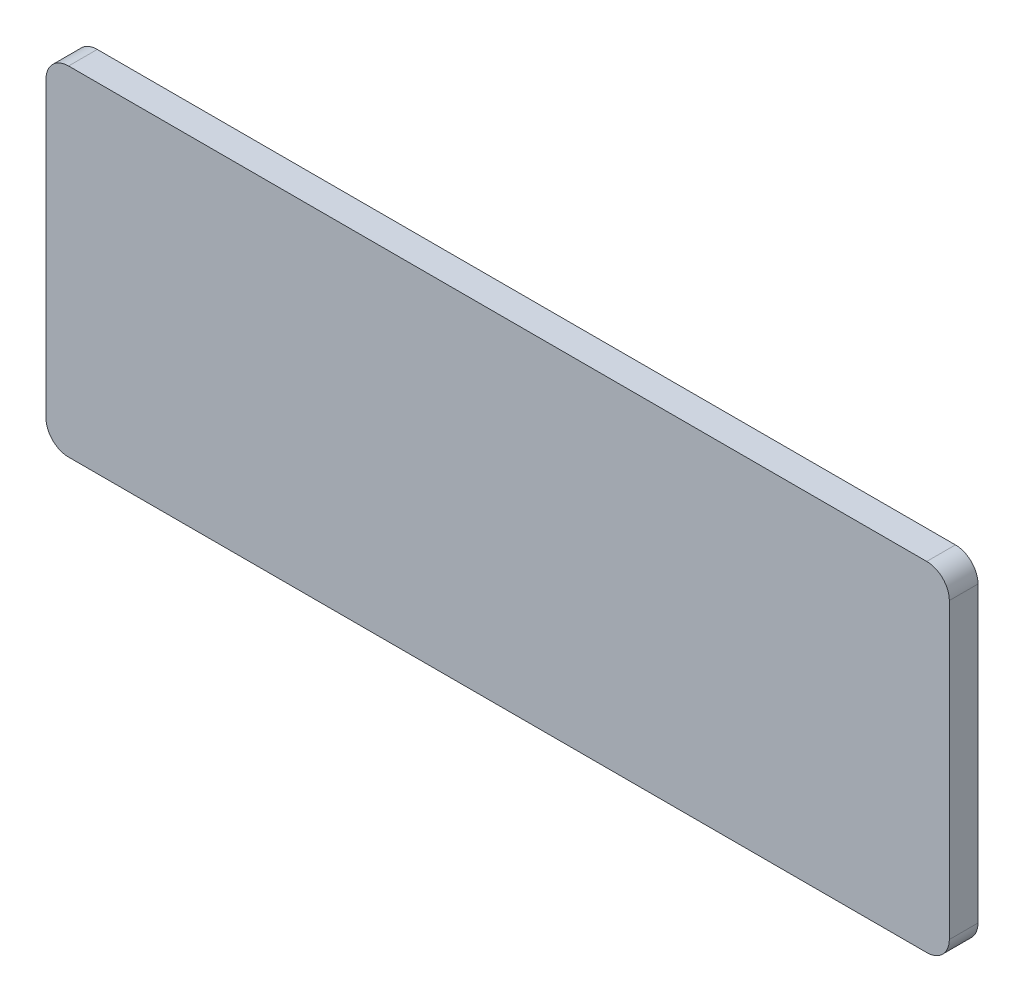
ISO-10303-21;
HEADER;
FILE_DESCRIPTION(('STEP AP214'),'2;1');
FILE_NAME('part.step','',(''),(''),'','','');
FILE_SCHEMA(('AUTOMOTIVE_DESIGN { 1 0 10303 214 1 1 1 1 }'));
ENDSEC;
DATA;
#1=APPLICATION_CONTEXT('core data for automotive mechanical design processes');
#2=APPLICATION_PROTOCOL_DEFINITION('international standard','automotive_design',2000,#1);
#3=PRODUCT_CONTEXT('',#1,'mechanical');
#4=PRODUCT('Part','Part','',(#3));
#5=PRODUCT_RELATED_PRODUCT_CATEGORY('part','',(#4));
#6=PRODUCT_DEFINITION_FORMATION('','',#4);
#7=PRODUCT_DEFINITION_CONTEXT('part definition',#1,'design');
#8=PRODUCT_DEFINITION('design','',#6,#7);
#9=PRODUCT_DEFINITION_SHAPE('','',#8);
#10=(LENGTH_UNIT() NAMED_UNIT(*) SI_UNIT(.MILLI.,.METRE.));
#11=(NAMED_UNIT(*) PLANE_ANGLE_UNIT() SI_UNIT($,.RADIAN.));
#12=(NAMED_UNIT(*) SI_UNIT($,.STERADIAN.) SOLID_ANGLE_UNIT());
#13=UNCERTAINTY_MEASURE_WITH_UNIT(LENGTH_MEASURE(1.E-05),#10,'distance_accuracy_value','');
#14=(GEOMETRIC_REPRESENTATION_CONTEXT(3) GLOBAL_UNCERTAINTY_ASSIGNED_CONTEXT((#13)) GLOBAL_UNIT_ASSIGNED_CONTEXT((#10,
#11,#12)) REPRESENTATION_CONTEXT('',''));
#15=CARTESIAN_POINT('',(0.,0.,0.));
#16=DIRECTION('',(0.,0.,1.));
#17=DIRECTION('',(1.,0.,0.));
#18=AXIS2_PLACEMENT_3D('',#15,#16,#17);
#19=CARTESIAN_POINT('',(100.,37.5,-6.35));
#20=DIRECTION('',(1.,0.,0.));
#21=DIRECTION('',(0.,0.,-1.));
#22=AXIS2_PLACEMENT_3D('',#19,#20,#21);
#23=PLANE('',#22);
#24=DIRECTION('',(0.,1.,0.));
#25=VECTOR('',#24,1.);
#26=CARTESIAN_POINT('',(100.,37.5,0.));
#27=LINE('',#26,#25);
#28=CARTESIAN_POINT('',(100.,-32.5,0.));
#29=VERTEX_POINT('',#28);
#30=CARTESIAN_POINT('',(100.,32.5,0.));
#31=VERTEX_POINT('',#30);
#32=EDGE_CURVE('E157',#29,#31,#27,.T.);
#33=ORIENTED_EDGE('',*,*,#32,.F.);
#34=DIRECTION('',(0.,0.,1.));
#35=VECTOR('',#34,1.);
#36=CARTESIAN_POINT('',(100.,-32.5,-6.35));
#37=LINE('',#36,#35);
#38=CARTESIAN_POINT('',(100.,-32.5,-6.35));
#39=VERTEX_POINT('',#38);
#40=EDGE_CURVE('E147',#29,#39,#37,.F.);
#41=ORIENTED_EDGE('',*,*,#40,.T.);
#42=DIRECTION('',(0.,1.,0.));
#43=VECTOR('',#42,1.);
#44=CARTESIAN_POINT('',(100.,37.5,-6.35));
#45=LINE('',#44,#43);
#46=CARTESIAN_POINT('',(100.,32.5,-6.35));
#47=VERTEX_POINT('',#46);
#48=EDGE_CURVE('E151',#39,#47,#45,.T.);
#49=ORIENTED_EDGE('',*,*,#48,.T.);
#50=DIRECTION('',(0.,0.,1.));
#51=VECTOR('',#50,1.);
#52=CARTESIAN_POINT('',(100.,32.5,-6.35));
#53=LINE('',#52,#51);
#54=EDGE_CURVE('E144',#47,#31,#53,.T.);
#55=ORIENTED_EDGE('',*,*,#54,.T.);
#56=EDGE_LOOP('',(#33,#41,#49,#55));
#57=FACE_BOUND('',#56,.T.);
#58=ADVANCED_FACE('F34',(#57),#23,.T.);
#59=CARTESIAN_POINT('',(-100.,-37.5,-6.35));
#60=DIRECTION('',(0.,-1.,0.));
#61=DIRECTION('',(0.,0.,-1.));
#62=AXIS2_PLACEMENT_3D('',#59,#60,#61);
#63=PLANE('',#62);
#64=DIRECTION('',(1.,0.,0.));
#65=VECTOR('',#64,1.);
#66=CARTESIAN_POINT('',(-100.,-37.5,0.));
#67=LINE('',#66,#65);
#68=CARTESIAN_POINT('',(-95.,-37.5,0.));
#69=VERTEX_POINT('',#68);
#70=CARTESIAN_POINT('',(94.9999999999999,-37.5,0.));
#71=VERTEX_POINT('',#70);
#72=EDGE_CURVE('E117',#69,#71,#67,.T.);
#73=ORIENTED_EDGE('',*,*,#72,.F.);
#74=DIRECTION('',(0.,0.,1.));
#75=VECTOR('',#74,1.);
#76=CARTESIAN_POINT('',(-95.,-37.5,-6.35));
#77=LINE('',#76,#75);
#78=CARTESIAN_POINT('',(-95.,-37.5,-6.35));
#79=VERTEX_POINT('',#78);
#80=EDGE_CURVE('E135',#69,#79,#77,.F.);
#81=ORIENTED_EDGE('',*,*,#80,.T.);
#82=DIRECTION('',(1.,0.,0.));
#83=VECTOR('',#82,1.);
#84=CARTESIAN_POINT('',(-100.,-37.5,-6.35));
#85=LINE('',#84,#83);
#86=CARTESIAN_POINT('',(94.9999999999999,-37.5,-6.35));
#87=VERTEX_POINT('',#86);
#88=EDGE_CURVE('E119',#79,#87,#85,.T.);
#89=ORIENTED_EDGE('',*,*,#88,.T.);
#90=DIRECTION('',(0.,0.,1.));
#91=VECTOR('',#90,1.);
#92=CARTESIAN_POINT('',(95.,-37.5,-6.35));
#93=LINE('',#92,#91);
#94=EDGE_CURVE('E132',#87,#71,#93,.T.);
#95=ORIENTED_EDGE('',*,*,#94,.T.);
#96=EDGE_LOOP('',(#73,#81,#89,#95));
#97=FACE_BOUND('',#96,.T.);
#98=ADVANCED_FACE('F175',(#97),#63,.T.);
#99=CARTESIAN_POINT('',(-100.,37.5,-6.35));
#100=DIRECTION('',(-1.,0.,0.));
#101=DIRECTION('',(0.,-1.,0.));
#102=AXIS2_PLACEMENT_3D('',#99,#100,#101);
#103=PLANE('',#102);
#104=DIRECTION('',(0.,-1.,0.));
#105=VECTOR('',#104,1.);
#106=CARTESIAN_POINT('',(-100.,37.5,-6.35));
#107=LINE('',#106,#105);
#108=CARTESIAN_POINT('',(-100.,32.5,-6.35));
#109=VERTEX_POINT('',#108);
#110=CARTESIAN_POINT('',(-100.,-32.5,-6.35));
#111=VERTEX_POINT('',#110);
#112=EDGE_CURVE('E123',#109,#111,#107,.T.);
#113=ORIENTED_EDGE('',*,*,#112,.T.);
#114=DIRECTION('',(0.,0.,1.));
#115=VECTOR('',#114,1.);
#116=CARTESIAN_POINT('',(-100.,-32.5,-6.35));
#117=LINE('',#116,#115);
#118=CARTESIAN_POINT('',(-100.,-32.5,0.));
#119=VERTEX_POINT('',#118);
#120=EDGE_CURVE('E109',#111,#119,#117,.T.);
#121=ORIENTED_EDGE('',*,*,#120,.T.);
#122=DIRECTION('',(0.,-1.,0.));
#123=VECTOR('',#122,1.);
#124=CARTESIAN_POINT('',(-100.,37.5,0.));
#125=LINE('',#124,#123);
#126=CARTESIAN_POINT('',(-100.,32.5,0.));
#127=VERTEX_POINT('',#126);
#128=EDGE_CURVE('E102',#127,#119,#125,.T.);
#129=ORIENTED_EDGE('',*,*,#128,.F.);
#130=DIRECTION('',(0.,0.,1.));
#131=VECTOR('',#130,1.);
#132=CARTESIAN_POINT('',(-100.,32.5,-6.35));
#133=LINE('',#132,#131);
#134=EDGE_CURVE('E115',#127,#109,#133,.F.);
#135=ORIENTED_EDGE('',*,*,#134,.T.);
#136=EDGE_LOOP('',(#113,#121,#129,#135));
#137=FACE_BOUND('',#136,.T.);
#138=ADVANCED_FACE('F114',(#137),#103,.T.);
#139=CARTESIAN_POINT('',(-100.,37.5,-6.35));
#140=DIRECTION('',(0.,1.,0.));
#141=DIRECTION('',(0.,0.,1.));
#142=AXIS2_PLACEMENT_3D('',#139,#140,#141);
#143=PLANE('',#142);
#144=DIRECTION('',(-1.,0.,0.));
#145=VECTOR('',#144,1.);
#146=CARTESIAN_POINT('',(-100.,37.5,0.));
#147=LINE('',#146,#145);
#148=CARTESIAN_POINT('',(95.,37.5,0.));
#149=VERTEX_POINT('',#148);
#150=CARTESIAN_POINT('',(-95.,37.5,0.));
#151=VERTEX_POINT('',#150);
#152=EDGE_CURVE('E103',#149,#151,#147,.T.);
#153=ORIENTED_EDGE('',*,*,#152,.F.);
#154=DIRECTION('',(0.,0.,1.));
#155=VECTOR('',#154,1.);
#156=CARTESIAN_POINT('',(95.,37.5,-6.35));
#157=LINE('',#156,#155);
#158=CARTESIAN_POINT('',(95.,37.5,-6.35));
#159=VERTEX_POINT('',#158);
#160=EDGE_CURVE('E11',#149,#159,#157,.F.);
#161=ORIENTED_EDGE('',*,*,#160,.T.);
#162=DIRECTION('',(-1.,0.,0.));
#163=VECTOR('',#162,1.);
#164=CARTESIAN_POINT('',(-100.,37.5,-6.35));
#165=LINE('',#164,#163);
#166=CARTESIAN_POINT('',(-95.,37.5,-6.35));
#167=VERTEX_POINT('',#166);
#168=EDGE_CURVE('E149',#159,#167,#165,.T.);
#169=ORIENTED_EDGE('',*,*,#168,.T.);
#170=DIRECTION('',(0.,0.,1.));
#171=VECTOR('',#170,1.);
#172=CARTESIAN_POINT('',(-95.,37.5,-6.35));
#173=LINE('',#172,#171);
#174=EDGE_CURVE('E42',#167,#151,#173,.T.);
#175=ORIENTED_EDGE('',*,*,#174,.T.);
#176=EDGE_LOOP('',(#153,#161,#169,#175));
#177=FACE_BOUND('',#176,.T.);
#178=ADVANCED_FACE('F148',(#177),#143,.T.);
#179=CARTESIAN_POINT('',(0.,0.,-6.35));
#180=DIRECTION('',(0.,0.,1.));
#181=DIRECTION('',(1.,0.,0.));
#182=AXIS2_PLACEMENT_3D('',#179,#180,#181);
#183=PLANE('',#182);
#184=ORIENTED_EDGE('',*,*,#88,.F.);
#185=CARTESIAN_POINT('',(-95.,-32.5,-6.35));
#186=DIRECTION('',(0.,0.,1.));
#187=DIRECTION('',(1.,0.,0.));
#188=AXIS2_PLACEMENT_3D('',#185,#186,#187);
#189=CIRCLE('',#188,5.);
#190=EDGE_CURVE('E142',#79,#111,#189,.F.);
#191=ORIENTED_EDGE('',*,*,#190,.T.);
#192=ORIENTED_EDGE('',*,*,#112,.F.);
#193=CARTESIAN_POINT('',(-95.,32.5,-6.35));
#194=DIRECTION('',(0.,0.,1.));
#195=DIRECTION('',(1.,0.,0.));
#196=AXIS2_PLACEMENT_3D('',#193,#194,#195);
#197=CIRCLE('',#196,5.);
#198=EDGE_CURVE('E49',#109,#167,#197,.F.);
#199=ORIENTED_EDGE('',*,*,#198,.T.);
#200=ORIENTED_EDGE('',*,*,#168,.F.);
#201=CARTESIAN_POINT('',(95.,32.5,-6.35));
#202=DIRECTION('',(0.,0.,1.));
#203=DIRECTION('',(1.,0.,0.));
#204=AXIS2_PLACEMENT_3D('',#201,#202,#203);
#205=CIRCLE('',#204,5.);
#206=EDGE_CURVE('E138',#159,#47,#205,.F.);
#207=ORIENTED_EDGE('',*,*,#206,.T.);
#208=ORIENTED_EDGE('',*,*,#48,.F.);
#209=CARTESIAN_POINT('',(95.,-32.5,-6.35));
#210=DIRECTION('',(0.,0.,1.));
#211=DIRECTION('',(1.,0.,0.));
#212=AXIS2_PLACEMENT_3D('',#209,#210,#211);
#213=CIRCLE('',#212,5.);
#214=EDGE_CURVE('E140',#39,#87,#213,.F.);
#215=ORIENTED_EDGE('',*,*,#214,.T.);
#216=EDGE_LOOP('',(#184,#191,#192,#199,#200,#207,#208,#215));
#217=FACE_BOUND('',#216,.T.);
#218=ADVANCED_FACE('F171',(#217),#183,.F.);
#219=CARTESIAN_POINT('',(0.,0.,0.));
#220=DIRECTION('',(0.,0.,1.));
#221=DIRECTION('',(1.,0.,0.));
#222=AXIS2_PLACEMENT_3D('',#219,#220,#221);
#223=PLANE('',#222);
#224=ORIENTED_EDGE('',*,*,#128,.T.);
#225=CARTESIAN_POINT('',(-95.,-32.5,0.));
#226=DIRECTION('',(0.,0.,1.));
#227=DIRECTION('',(1.,0.,0.));
#228=AXIS2_PLACEMENT_3D('',#225,#226,#227);
#229=CIRCLE('',#228,5.);
#230=EDGE_CURVE('E130',#119,#69,#229,.T.);
#231=ORIENTED_EDGE('',*,*,#230,.T.);
#232=ORIENTED_EDGE('',*,*,#72,.T.);
#233=CARTESIAN_POINT('',(95.,-32.5,0.));
#234=DIRECTION('',(0.,0.,1.));
#235=DIRECTION('',(1.,0.,0.));
#236=AXIS2_PLACEMENT_3D('',#233,#234,#235);
#237=CIRCLE('',#236,5.);
#238=EDGE_CURVE('E128',#71,#29,#237,.T.);
#239=ORIENTED_EDGE('',*,*,#238,.T.);
#240=ORIENTED_EDGE('',*,*,#32,.T.);
#241=CARTESIAN_POINT('',(95.,32.5,0.));
#242=DIRECTION('',(0.,0.,1.));
#243=DIRECTION('',(1.,0.,0.));
#244=AXIS2_PLACEMENT_3D('',#241,#242,#243);
#245=CIRCLE('',#244,5.);
#246=EDGE_CURVE('E108',#31,#149,#245,.T.);
#247=ORIENTED_EDGE('',*,*,#246,.T.);
#248=ORIENTED_EDGE('',*,*,#152,.T.);
#249=CARTESIAN_POINT('',(-95.,32.5,0.));
#250=DIRECTION('',(0.,0.,1.));
#251=DIRECTION('',(1.,0.,0.));
#252=AXIS2_PLACEMENT_3D('',#249,#250,#251);
#253=CIRCLE('',#252,5.);
#254=EDGE_CURVE('E99',#151,#127,#253,.T.);
#255=ORIENTED_EDGE('',*,*,#254,.T.);
#256=EDGE_LOOP('',(#224,#231,#232,#239,#240,#247,#248,#255));
#257=FACE_BOUND('',#256,.T.);
#258=ADVANCED_FACE('F101',(#257),#223,.T.);
#259=CARTESIAN_POINT('',(-95.,-32.5,-6.35));
#260=DIRECTION('',(0.,0.,1.));
#261=DIRECTION('',(1.,0.,0.));
#262=AXIS2_PLACEMENT_3D('',#259,#260,#261);
#263=CYLINDRICAL_SURFACE('',#262,5.);
#264=ORIENTED_EDGE('',*,*,#190,.F.);
#265=ORIENTED_EDGE('',*,*,#80,.F.);
#266=ORIENTED_EDGE('',*,*,#230,.F.);
#267=ORIENTED_EDGE('',*,*,#120,.F.);
#268=EDGE_LOOP('',(#264,#265,#266,#267));
#269=FACE_BOUND('',#268,.T.);
#270=ADVANCED_FACE('F178',(#269),#263,.T.);
#271=CARTESIAN_POINT('',(95.,-32.5,-6.35));
#272=DIRECTION('',(0.,0.,1.));
#273=DIRECTION('',(1.,0.,0.));
#274=AXIS2_PLACEMENT_3D('',#271,#272,#273);
#275=CYLINDRICAL_SURFACE('',#274,5.);
#276=ORIENTED_EDGE('',*,*,#214,.F.);
#277=ORIENTED_EDGE('',*,*,#40,.F.);
#278=ORIENTED_EDGE('',*,*,#238,.F.);
#279=ORIENTED_EDGE('',*,*,#94,.F.);
#280=EDGE_LOOP('',(#276,#277,#278,#279));
#281=FACE_BOUND('',#280,.T.);
#282=ADVANCED_FACE('F168',(#281),#275,.T.);
#283=CARTESIAN_POINT('',(95.,32.5,-6.35));
#284=DIRECTION('',(0.,0.,1.));
#285=DIRECTION('',(1.,0.,0.));
#286=AXIS2_PLACEMENT_3D('',#283,#284,#285);
#287=CYLINDRICAL_SURFACE('',#286,5.);
#288=ORIENTED_EDGE('',*,*,#206,.F.);
#289=ORIENTED_EDGE('',*,*,#160,.F.);
#290=ORIENTED_EDGE('',*,*,#246,.F.);
#291=ORIENTED_EDGE('',*,*,#54,.F.);
#292=EDGE_LOOP('',(#288,#289,#290,#291));
#293=FACE_BOUND('',#292,.T.);
#294=ADVANCED_FACE('F185',(#293),#287,.T.);
#295=CARTESIAN_POINT('',(-95.,32.5,-6.35));
#296=DIRECTION('',(0.,0.,1.));
#297=DIRECTION('',(1.,0.,0.));
#298=AXIS2_PLACEMENT_3D('',#295,#296,#297);
#299=CYLINDRICAL_SURFACE('',#298,5.);
#300=ORIENTED_EDGE('',*,*,#198,.F.);
#301=ORIENTED_EDGE('',*,*,#134,.F.);
#302=ORIENTED_EDGE('',*,*,#254,.F.);
#303=ORIENTED_EDGE('',*,*,#174,.F.);
#304=EDGE_LOOP('',(#300,#301,#302,#303));
#305=FACE_BOUND('',#304,.T.);
#306=ADVANCED_FACE('F36',(#305),#299,.T.);
#307=CLOSED_SHELL('',(#58,#98,#138,#178,#218,#258,#270,#282,#294,#306));
#308=MANIFOLD_SOLID_BREP('B2',#307);
#309=ADVANCED_BREP_SHAPE_REPRESENTATION('',(#18,#308),#14);
#310=SHAPE_DEFINITION_REPRESENTATION(#9,#309);
ENDSEC;
END-ISO-10303-21;
